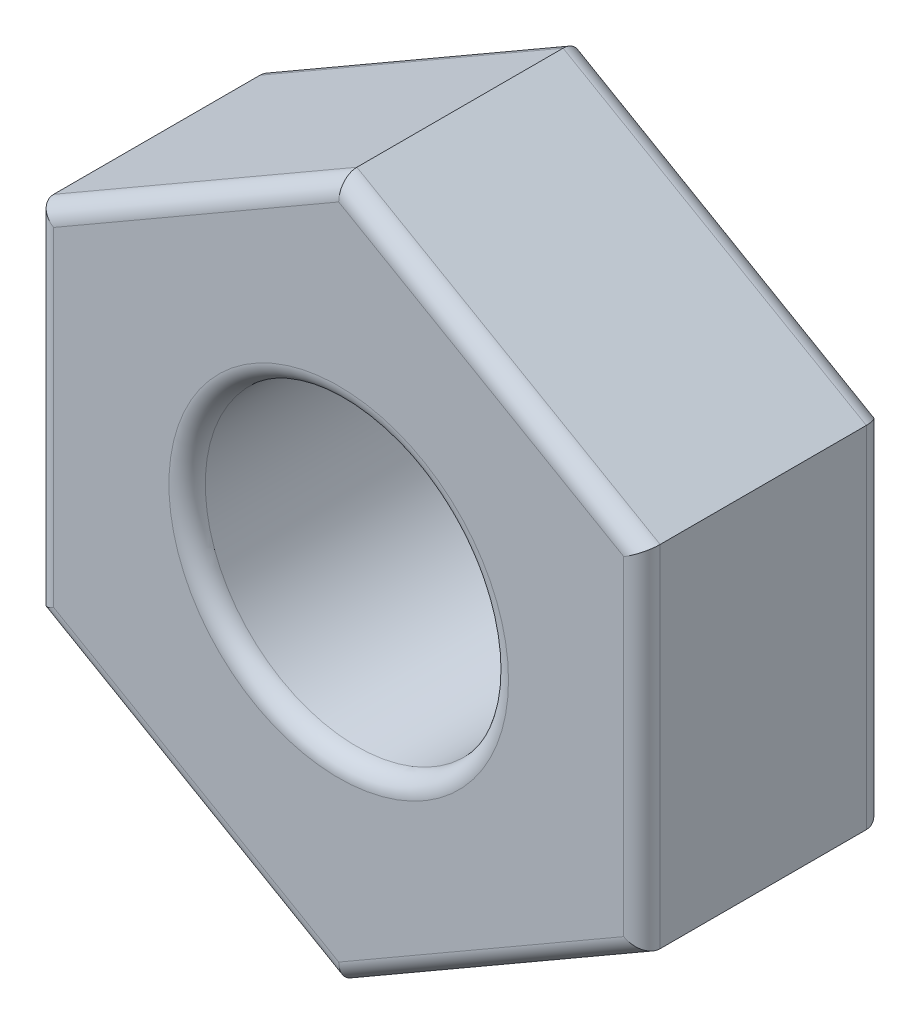
ISO-10303-21;
HEADER;
FILE_DESCRIPTION(('STEP AP214'),'2;1');
FILE_NAME('part.step','',(''),(''),'','','');
FILE_SCHEMA(('AUTOMOTIVE_DESIGN { 1 0 10303 214 1 1 1 1 }'));
ENDSEC;
DATA;
#1=APPLICATION_CONTEXT('core data for automotive mechanical design processes');
#2=APPLICATION_PROTOCOL_DEFINITION('international standard','automotive_design',2000,#1);
#3=PRODUCT_CONTEXT('',#1,'mechanical');
#4=PRODUCT('Part','Part','',(#3));
#5=PRODUCT_RELATED_PRODUCT_CATEGORY('part','',(#4));
#6=PRODUCT_DEFINITION_FORMATION('','',#4);
#7=PRODUCT_DEFINITION_CONTEXT('part definition',#1,'design');
#8=PRODUCT_DEFINITION('design','',#6,#7);
#9=PRODUCT_DEFINITION_SHAPE('','',#8);
#10=(LENGTH_UNIT() NAMED_UNIT(*) SI_UNIT(.MILLI.,.METRE.));
#11=(NAMED_UNIT(*) PLANE_ANGLE_UNIT() SI_UNIT($,.RADIAN.));
#12=(NAMED_UNIT(*) SI_UNIT($,.STERADIAN.) SOLID_ANGLE_UNIT());
#13=UNCERTAINTY_MEASURE_WITH_UNIT(LENGTH_MEASURE(1.E-05),#10,'distance_accuracy_value','');
#14=(GEOMETRIC_REPRESENTATION_CONTEXT(3) GLOBAL_UNCERTAINTY_ASSIGNED_CONTEXT((#13)) GLOBAL_UNIT_ASSIGNED_CONTEXT((#10,
#11,#12)) REPRESENTATION_CONTEXT('',''));
#15=CARTESIAN_POINT('',(0.,0.,0.));
#16=DIRECTION('',(0.,0.,1.));
#17=DIRECTION('',(1.,0.,0.));
#18=AXIS2_PLACEMENT_3D('',#15,#16,#17);
#19=CARTESIAN_POINT('',(0.,0.,2.));
#20=DIRECTION('',(0.,0.,1.));
#21=DIRECTION('',(1.,0.,0.));
#22=AXIS2_PLACEMENT_3D('',#19,#20,#21);
#23=PLANE('',#22);
#24=CARTESIAN_POINT('',(0.,0.,2.));
#25=DIRECTION('',(0.,0.,1.));
#26=DIRECTION('',(1.,0.,0.));
#27=AXIS2_PLACEMENT_3D('',#24,#25,#26);
#28=CIRCLE('',#27,1.4);
#29=CARTESIAN_POINT('',(1.4,0.,2.));
#30=VERTEX_POINT('',#29);
#31=EDGE_CURVE('E11',#30,#30,#28,.F.);
#32=ORIENTED_EDGE('',*,*,#31,.T.);
#33=EDGE_LOOP('',(#32));
#34=FACE_BOUND('',#33,.T.);
#35=DIRECTION('',(0.866025403784439,0.5,0.));
#36=VECTOR('',#35,1.);
#37=CARTESIAN_POINT('',(2.425,-1.3134718624064,2.));
#38=LINE('',#37,#36);
#39=CARTESIAN_POINT('',(0.,-2.71354626519124,2.));
#40=VERTEX_POINT('',#39);
#41=CARTESIAN_POINT('',(2.35,-1.35677313259562,2.));
#42=VERTEX_POINT('',#41);
#43=EDGE_CURVE('E53',#40,#42,#38,.T.);
#44=ORIENTED_EDGE('',*,*,#43,.T.);
#45=DIRECTION('',(0.,1.,0.));
#46=VECTOR('',#45,1.);
#47=CARTESIAN_POINT('',(2.35,1.44337567297407,2.));
#48=LINE('',#47,#46);
#49=CARTESIAN_POINT('',(2.35,1.35677313259562,2.));
#50=VERTEX_POINT('',#49);
#51=EDGE_CURVE('E45',#42,#50,#48,.T.);
#52=ORIENTED_EDGE('',*,*,#51,.T.);
#53=DIRECTION('',(-0.866025403784439,0.5,0.));
#54=VECTOR('',#53,1.);
#55=CARTESIAN_POINT('',(-0.075,2.75684753538046,2.));
#56=LINE('',#55,#54);
#57=CARTESIAN_POINT('',(0.,2.71354626519124,2.));
#58=VERTEX_POINT('',#57);
#59=EDGE_CURVE('E192',#50,#58,#56,.T.);
#60=ORIENTED_EDGE('',*,*,#59,.T.);
#61=DIRECTION('',(-0.866025403784439,-0.5,0.));
#62=VECTOR('',#61,1.);
#63=CARTESIAN_POINT('',(-2.425,1.3134718624064,2.));
#64=LINE('',#63,#62);
#65=CARTESIAN_POINT('',(-2.35,1.35677313259562,2.));
#66=VERTEX_POINT('',#65);
#67=EDGE_CURVE('E194',#58,#66,#64,.T.);
#68=ORIENTED_EDGE('',*,*,#67,.T.);
#69=DIRECTION('',(0.,-1.,0.));
#70=VECTOR('',#69,1.);
#71=CARTESIAN_POINT('',(-2.35,-1.44337567297406,2.));
#72=LINE('',#71,#70);
#73=CARTESIAN_POINT('',(-2.35,-1.35677313259562,2.));
#74=VERTEX_POINT('',#73);
#75=EDGE_CURVE('E196',#66,#74,#72,.T.);
#76=ORIENTED_EDGE('',*,*,#75,.T.);
#77=DIRECTION('',(0.866025403784439,-0.5,0.));
#78=VECTOR('',#77,1.);
#79=CARTESIAN_POINT('',(0.0749999999999995,-2.75684753538046,2.));
#80=LINE('',#79,#78);
#81=EDGE_CURVE('E58',#74,#40,#80,.T.);
#82=ORIENTED_EDGE('',*,*,#81,.T.);
#83=EDGE_LOOP('',(#44,#52,#60,#68,#76,#82));
#84=FACE_BOUND('',#83,.T.);
#85=ADVANCED_FACE('F36',(#34,#84),#23,.T.);
#86=CARTESIAN_POINT('',(0.,0.,0.));
#87=DIRECTION('',(0.,0.,1.));
#88=DIRECTION('',(1.,0.,0.));
#89=AXIS2_PLACEMENT_3D('',#86,#87,#88);
#90=PLANE('',#89);
#91=CARTESIAN_POINT('',(0.,0.,0.));
#92=DIRECTION('',(0.,0.,1.));
#93=DIRECTION('',(1.,0.,0.));
#94=AXIS2_PLACEMENT_3D('',#91,#92,#93);
#95=CIRCLE('',#94,1.4);
#96=CARTESIAN_POINT('',(1.4,0.,0.));
#97=VERTEX_POINT('',#96);
#98=EDGE_CURVE('E154',#97,#97,#95,.T.);
#99=ORIENTED_EDGE('',*,*,#98,.T.);
#100=EDGE_LOOP('',(#99));
#101=FACE_BOUND('',#100,.T.);
#102=DIRECTION('',(0.,-1.,0.));
#103=VECTOR('',#102,1.);
#104=CARTESIAN_POINT('',(-2.35,0.,0.));
#105=LINE('',#104,#103);
#106=CARTESIAN_POINT('',(-2.35,-1.35677313259562,0.));
#107=VERTEX_POINT('',#106);
#108=CARTESIAN_POINT('',(-2.35,1.35677313259562,0.));
#109=VERTEX_POINT('',#108);
#110=EDGE_CURVE('E153',#107,#109,#105,.F.);
#111=ORIENTED_EDGE('',*,*,#110,.T.);
#112=DIRECTION('',(-0.866025403784439,-0.5,0.));
#113=VECTOR('',#112,1.);
#114=CARTESIAN_POINT('',(-1.175,2.03515969889343,0.));
#115=LINE('',#114,#113);
#116=CARTESIAN_POINT('',(0.,2.71354626519124,0.));
#117=VERTEX_POINT('',#116);
#118=EDGE_CURVE('E132',#109,#117,#115,.F.);
#119=ORIENTED_EDGE('',*,*,#118,.T.);
#120=DIRECTION('',(-0.866025403784439,0.5,0.));
#121=VECTOR('',#120,1.);
#122=CARTESIAN_POINT('',(1.175,2.03515969889343,0.));
#123=LINE('',#122,#121);
#124=CARTESIAN_POINT('',(2.35,1.35677313259562,0.));
#125=VERTEX_POINT('',#124);
#126=EDGE_CURVE('E142',#117,#125,#123,.F.);
#127=ORIENTED_EDGE('',*,*,#126,.T.);
#128=DIRECTION('',(0.,1.,0.));
#129=VECTOR('',#128,1.);
#130=CARTESIAN_POINT('',(2.35,0.,0.));
#131=LINE('',#130,#129);
#132=CARTESIAN_POINT('',(2.35,-1.35677313259562,0.));
#133=VERTEX_POINT('',#132);
#134=EDGE_CURVE('E148',#125,#133,#131,.F.);
#135=ORIENTED_EDGE('',*,*,#134,.T.);
#136=DIRECTION('',(0.866025403784439,0.5,0.));
#137=VECTOR('',#136,1.);
#138=CARTESIAN_POINT('',(1.175,-2.03515969889343,0.));
#139=LINE('',#138,#137);
#140=CARTESIAN_POINT('',(0.,-2.71354626519124,0.));
#141=VERTEX_POINT('',#140);
#142=EDGE_CURVE('E254',#133,#141,#139,.F.);
#143=ORIENTED_EDGE('',*,*,#142,.T.);
#144=DIRECTION('',(0.866025403784439,-0.5,0.));
#145=VECTOR('',#144,1.);
#146=CARTESIAN_POINT('',(-1.175,-2.03515969889343,0.));
#147=LINE('',#146,#145);
#148=EDGE_CURVE('E159',#141,#107,#147,.F.);
#149=ORIENTED_EDGE('',*,*,#148,.T.);
#150=EDGE_LOOP('',(#111,#119,#127,#135,#143,#149));
#151=FACE_BOUND('',#150,.T.);
#152=ADVANCED_FACE('F151',(#101,#151),#90,.F.);
#153=CARTESIAN_POINT('',(2.5,1.44337567297407,2.));
#154=DIRECTION('',(-0.5,-0.866025403784439,0.));
#155=DIRECTION('',(0.866025403784439,-0.5,0.));
#156=AXIS2_PLACEMENT_3D('',#153,#154,#155);
#157=PLANE('',#156);
#158=DIRECTION('',(0.,0.,-1.));
#159=VECTOR('',#158,1.);
#160=CARTESIAN_POINT('',(2.5,1.44337567297407,2.));
#161=LINE('',#160,#159);
#162=CARTESIAN_POINT('',(2.5,1.44337567297407,1.85));
#163=VERTEX_POINT('',#162);
#164=CARTESIAN_POINT('',(2.5,1.44337567297407,0.15));
#165=VERTEX_POINT('',#164);
#166=EDGE_CURVE('E211',#163,#165,#161,.T.);
#167=ORIENTED_EDGE('',*,*,#166,.T.);
#168=DIRECTION('',(-0.866025403784439,0.5,0.));
#169=VECTOR('',#168,1.);
#170=CARTESIAN_POINT('',(2.5,1.44337567297407,0.15));
#171=LINE('',#170,#169);
#172=CARTESIAN_POINT('',(0.,2.88675134594813,0.15));
#173=VERTEX_POINT('',#172);
#174=EDGE_CURVE('E190',#165,#173,#171,.T.);
#175=ORIENTED_EDGE('',*,*,#174,.T.);
#176=DIRECTION('',(0.,0.,-1.));
#177=VECTOR('',#176,1.);
#178=CARTESIAN_POINT('',(0.,2.88675134594813,2.));
#179=LINE('',#178,#177);
#180=CARTESIAN_POINT('',(0.,2.88675134594813,1.85));
#181=VERTEX_POINT('',#180);
#182=EDGE_CURVE('E149',#181,#173,#179,.T.);
#183=ORIENTED_EDGE('',*,*,#182,.F.);
#184=DIRECTION('',(-0.866025403784439,0.5,0.));
#185=VECTOR('',#184,1.);
#186=CARTESIAN_POINT('',(2.5,1.44337567297407,1.85));
#187=LINE('',#186,#185);
#188=EDGE_CURVE('E188',#181,#163,#187,.F.);
#189=ORIENTED_EDGE('',*,*,#188,.T.);
#190=EDGE_LOOP('',(#167,#175,#183,#189));
#191=FACE_BOUND('',#190,.T.);
#192=ADVANCED_FACE('F278',(#191),#157,.F.);
#193=CARTESIAN_POINT('',(0.,2.88675134594813,2.));
#194=DIRECTION('',(0.5,-0.866025403784439,0.));
#195=DIRECTION('',(0.866025403784439,0.5,0.));
#196=AXIS2_PLACEMENT_3D('',#193,#194,#195);
#197=PLANE('',#196);
#198=ORIENTED_EDGE('',*,*,#182,.T.);
#199=DIRECTION('',(-0.866025403784439,-0.5,0.));
#200=VECTOR('',#199,1.);
#201=CARTESIAN_POINT('',(0.,2.88675134594813,0.15));
#202=LINE('',#201,#200);
#203=CARTESIAN_POINT('',(-2.5,1.44337567297407,0.15));
#204=VERTEX_POINT('',#203);
#205=EDGE_CURVE('E135',#173,#204,#202,.T.);
#206=ORIENTED_EDGE('',*,*,#205,.T.);
#207=DIRECTION('',(0.,0.,-1.));
#208=VECTOR('',#207,1.);
#209=CARTESIAN_POINT('',(-2.5,1.44337567297407,2.));
#210=LINE('',#209,#208);
#211=CARTESIAN_POINT('',(-2.5,1.44337567297407,1.85));
#212=VERTEX_POINT('',#211);
#213=EDGE_CURVE('E240',#212,#204,#210,.T.);
#214=ORIENTED_EDGE('',*,*,#213,.F.);
#215=DIRECTION('',(-0.866025403784439,-0.5,0.));
#216=VECTOR('',#215,1.);
#217=CARTESIAN_POINT('',(0.,2.88675134594813,1.85));
#218=LINE('',#217,#216);
#219=EDGE_CURVE('E168',#212,#181,#218,.F.);
#220=ORIENTED_EDGE('',*,*,#219,.T.);
#221=EDGE_LOOP('',(#198,#206,#214,#220));
#222=FACE_BOUND('',#221,.T.);
#223=ADVANCED_FACE('F245',(#222),#197,.F.);
#224=CARTESIAN_POINT('',(-2.5,1.44337567297407,2.));
#225=DIRECTION('',(1.,0.,0.));
#226=DIRECTION('',(0.,1.,0.));
#227=AXIS2_PLACEMENT_3D('',#224,#225,#226);
#228=PLANE('',#227);
#229=ORIENTED_EDGE('',*,*,#213,.T.);
#230=DIRECTION('',(0.,-1.,0.));
#231=VECTOR('',#230,1.);
#232=CARTESIAN_POINT('',(-2.5,1.44337567297407,0.15));
#233=LINE('',#232,#231);
#234=CARTESIAN_POINT('',(-2.5,-1.44337567297406,0.15));
#235=VERTEX_POINT('',#234);
#236=EDGE_CURVE('E173',#204,#235,#233,.T.);
#237=ORIENTED_EDGE('',*,*,#236,.T.);
#238=DIRECTION('',(0.,0.,-1.));
#239=VECTOR('',#238,1.);
#240=CARTESIAN_POINT('',(-2.5,-1.44337567297406,2.));
#241=LINE('',#240,#239);
#242=CARTESIAN_POINT('',(-2.5,-1.44337567297406,1.85));
#243=VERTEX_POINT('',#242);
#244=EDGE_CURVE('E242',#243,#235,#241,.T.);
#245=ORIENTED_EDGE('',*,*,#244,.F.);
#246=DIRECTION('',(0.,-1.,0.));
#247=VECTOR('',#246,1.);
#248=CARTESIAN_POINT('',(-2.5,1.44337567297407,1.85));
#249=LINE('',#248,#247);
#250=EDGE_CURVE('E171',#243,#212,#249,.F.);
#251=ORIENTED_EDGE('',*,*,#250,.T.);
#252=EDGE_LOOP('',(#229,#237,#245,#251));
#253=FACE_BOUND('',#252,.T.);
#254=ADVANCED_FACE('F239',(#253),#228,.F.);
#255=CARTESIAN_POINT('',(-2.5,-1.44337567297406,2.));
#256=DIRECTION('',(0.5,0.866025403784439,0.));
#257=DIRECTION('',(-0.866025403784439,0.5,0.));
#258=AXIS2_PLACEMENT_3D('',#255,#256,#257);
#259=PLANE('',#258);
#260=ORIENTED_EDGE('',*,*,#244,.T.);
#261=DIRECTION('',(0.866025403784439,-0.5,0.));
#262=VECTOR('',#261,1.);
#263=CARTESIAN_POINT('',(-2.5,-1.44337567297406,0.15));
#264=LINE('',#263,#262);
#265=CARTESIAN_POINT('',(0.,-2.88675134594813,0.15));
#266=VERTEX_POINT('',#265);
#267=EDGE_CURVE('E177',#235,#266,#264,.T.);
#268=ORIENTED_EDGE('',*,*,#267,.T.);
#269=DIRECTION('',(0.,0.,-1.));
#270=VECTOR('',#269,1.);
#271=CARTESIAN_POINT('',(0.,-2.88675134594813,2.));
#272=LINE('',#271,#270);
#273=CARTESIAN_POINT('',(0.,-2.88675134594813,1.85));
#274=VERTEX_POINT('',#273);
#275=EDGE_CURVE('E249',#274,#266,#272,.T.);
#276=ORIENTED_EDGE('',*,*,#275,.F.);
#277=DIRECTION('',(0.866025403784439,-0.5,0.));
#278=VECTOR('',#277,1.);
#279=CARTESIAN_POINT('',(-2.5,-1.44337567297406,1.85));
#280=LINE('',#279,#278);
#281=EDGE_CURVE('E175',#274,#243,#280,.F.);
#282=ORIENTED_EDGE('',*,*,#281,.T.);
#283=EDGE_LOOP('',(#260,#268,#276,#282));
#284=FACE_BOUND('',#283,.T.);
#285=ADVANCED_FACE('F266',(#284),#259,.F.);
#286=CARTESIAN_POINT('',(0.,-2.88675134594813,2.));
#287=DIRECTION('',(-0.5,0.866025403784439,0.));
#288=DIRECTION('',(-0.866025403784439,-0.5,0.));
#289=AXIS2_PLACEMENT_3D('',#286,#287,#288);
#290=PLANE('',#289);
#291=ORIENTED_EDGE('',*,*,#275,.T.);
#292=DIRECTION('',(0.866025403784439,0.5,0.));
#293=VECTOR('',#292,1.);
#294=CARTESIAN_POINT('',(0.,-2.88675134594813,0.15));
#295=LINE('',#294,#293);
#296=CARTESIAN_POINT('',(2.5,-1.44337567297407,0.15));
#297=VERTEX_POINT('',#296);
#298=EDGE_CURVE('E181',#266,#297,#295,.T.);
#299=ORIENTED_EDGE('',*,*,#298,.T.);
#300=DIRECTION('',(0.,0.,-1.));
#301=VECTOR('',#300,1.);
#302=CARTESIAN_POINT('',(2.5,-1.44337567297407,2.));
#303=LINE('',#302,#301);
#304=CARTESIAN_POINT('',(2.5,-1.44337567297407,1.85));
#305=VERTEX_POINT('',#304);
#306=EDGE_CURVE('E271',#305,#297,#303,.T.);
#307=ORIENTED_EDGE('',*,*,#306,.F.);
#308=DIRECTION('',(0.866025403784439,0.5,0.));
#309=VECTOR('',#308,1.);
#310=CARTESIAN_POINT('',(0.,-2.88675134594813,1.85));
#311=LINE('',#310,#309);
#312=EDGE_CURVE('E179',#305,#274,#311,.F.);
#313=ORIENTED_EDGE('',*,*,#312,.T.);
#314=EDGE_LOOP('',(#291,#299,#307,#313));
#315=FACE_BOUND('',#314,.T.);
#316=ADVANCED_FACE('F289',(#315),#290,.F.);
#317=CARTESIAN_POINT('',(2.5,-1.44337567297407,2.));
#318=DIRECTION('',(-1.,0.,0.));
#319=DIRECTION('',(0.,0.,1.));
#320=AXIS2_PLACEMENT_3D('',#317,#318,#319);
#321=PLANE('',#320);
#322=ORIENTED_EDGE('',*,*,#306,.T.);
#323=DIRECTION('',(0.,1.,0.));
#324=VECTOR('',#323,1.);
#325=CARTESIAN_POINT('',(2.5,-1.44337567297407,0.15));
#326=LINE('',#325,#324);
#327=EDGE_CURVE('E186',#297,#165,#326,.T.);
#328=ORIENTED_EDGE('',*,*,#327,.T.);
#329=ORIENTED_EDGE('',*,*,#166,.F.);
#330=DIRECTION('',(0.,1.,0.));
#331=VECTOR('',#330,1.);
#332=CARTESIAN_POINT('',(2.5,-1.44337567297407,1.85));
#333=LINE('',#332,#331);
#334=EDGE_CURVE('E183',#163,#305,#333,.F.);
#335=ORIENTED_EDGE('',*,*,#334,.T.);
#336=EDGE_LOOP('',(#322,#328,#329,#335));
#337=FACE_BOUND('',#336,.T.);
#338=ADVANCED_FACE('F290',(#337),#321,.F.);
#339=CARTESIAN_POINT('',(0.,0.,2.));
#340=DIRECTION('',(0.,0.,-1.));
#341=DIRECTION('',(-1.,0.,0.));
#342=AXIS2_PLACEMENT_3D('',#339,#340,#341);
#343=CYLINDRICAL_SURFACE('',#342,1.25);
#344=CARTESIAN_POINT('',(0.,0.,0.15));
#345=DIRECTION('',(0.,0.,1.));
#346=DIRECTION('',(1.,0.,0.));
#347=AXIS2_PLACEMENT_3D('',#344,#345,#346);
#348=CIRCLE('',#347,1.25);
#349=CARTESIAN_POINT('',(1.25,0.,0.15));
#350=VERTEX_POINT('',#349);
#351=EDGE_CURVE('E165',#350,#350,#348,.F.);
#352=ORIENTED_EDGE('',*,*,#351,.T.);
#353=EDGE_LOOP('',(#352));
#354=FACE_BOUND('',#353,.T.);
#355=CARTESIAN_POINT('',(0.,0.,1.85));
#356=DIRECTION('',(0.,0.,1.));
#357=DIRECTION('',(1.,0.,0.));
#358=AXIS2_PLACEMENT_3D('',#355,#356,#357);
#359=CIRCLE('',#358,1.25);
#360=CARTESIAN_POINT('',(1.25,0.,1.85));
#361=VERTEX_POINT('',#360);
#362=EDGE_CURVE('E157',#361,#361,#359,.T.);
#363=ORIENTED_EDGE('',*,*,#362,.T.);
#364=EDGE_LOOP('',(#363));
#365=FACE_BOUND('',#364,.T.);
#366=ADVANCED_FACE('F309',(#354,#365),#343,.F.);
#367=CARTESIAN_POINT('',(0.,0.,0.15));
#368=DIRECTION('',(0.,0.,1.));
#369=DIRECTION('',(1.,0.,0.));
#370=AXIS2_PLACEMENT_3D('',#367,#368,#369);
#371=TOROIDAL_SURFACE('',#370,1.4,0.15);
#372=ORIENTED_EDGE('',*,*,#351,.F.);
#373=EDGE_LOOP('',(#372));
#374=FACE_BOUND('',#373,.T.);
#375=ORIENTED_EDGE('',*,*,#98,.F.);
#376=EDGE_LOOP('',(#375));
#377=FACE_BOUND('',#376,.T.);
#378=ADVANCED_FACE('F323',(#374,#377),#371,.T.);
#379=CARTESIAN_POINT('',(-0.0750000000000005,-2.75684753538046,0.15));
#380=DIRECTION('',(0.866025403784439,0.5,0.));
#381=DIRECTION('',(-0.5,0.866025403784439,0.));
#382=AXIS2_PLACEMENT_3D('',#379,#380,#381);
#383=CYLINDRICAL_SURFACE('',#382,0.15);
#384=CARTESIAN_POINT('',(0.,-2.71354626519124,0.15));
#385=DIRECTION('',(1.,0.,0.));
#386=DIRECTION('',(0.,1.,0.));
#387=AXIS2_PLACEMENT_3D('',#384,#385,#386);
#388=ELLIPSE('',#387,0.173205080756888,0.15);
#389=EDGE_CURVE('E205',#141,#266,#388,.F.);
#390=ORIENTED_EDGE('',*,*,#389,.F.);
#391=ORIENTED_EDGE('',*,*,#142,.F.);
#392=CARTESIAN_POINT('',(2.35,-1.35677313259562,0.15));
#393=DIRECTION('',(0.5,0.866025403784439,0.));
#394=DIRECTION('',(-0.866025403784439,0.5,0.));
#395=AXIS2_PLACEMENT_3D('',#392,#393,#394);
#396=ELLIPSE('',#395,0.173205080756888,0.15);
#397=EDGE_CURVE('E208',#297,#133,#396,.T.);
#398=ORIENTED_EDGE('',*,*,#397,.F.);
#399=ORIENTED_EDGE('',*,*,#298,.F.);
#400=EDGE_LOOP('',(#390,#391,#398,#399));
#401=FACE_BOUND('',#400,.T.);
#402=ADVANCED_FACE('F287',(#401),#383,.T.);
#403=CARTESIAN_POINT('',(2.35,-1.44337567297407,0.15));
#404=DIRECTION('',(0.,1.,0.));
#405=DIRECTION('',(0.,0.,1.));
#406=AXIS2_PLACEMENT_3D('',#403,#404,#405);
#407=CYLINDRICAL_SURFACE('',#406,0.15);
#408=ORIENTED_EDGE('',*,*,#397,.T.);
#409=ORIENTED_EDGE('',*,*,#134,.F.);
#410=CARTESIAN_POINT('',(2.35,1.35677313259562,0.15));
#411=DIRECTION('',(-0.5,0.866025403784439,0.));
#412=DIRECTION('',(-0.866025403784439,-0.5,0.));
#413=AXIS2_PLACEMENT_3D('',#410,#411,#412);
#414=ELLIPSE('',#413,0.173205080756888,0.15);
#415=EDGE_CURVE('E145',#165,#125,#414,.T.);
#416=ORIENTED_EDGE('',*,*,#415,.F.);
#417=ORIENTED_EDGE('',*,*,#327,.F.);
#418=EDGE_LOOP('',(#408,#409,#416,#417));
#419=FACE_BOUND('',#418,.T.);
#420=ADVANCED_FACE('F284',(#419),#407,.T.);
#421=CARTESIAN_POINT('',(-2.425,-1.3134718624064,0.15));
#422=DIRECTION('',(0.866025403784439,-0.5,0.));
#423=DIRECTION('',(0.5,0.866025403784439,0.));
#424=AXIS2_PLACEMENT_3D('',#421,#422,#423);
#425=CYLINDRICAL_SURFACE('',#424,0.15);
#426=ORIENTED_EDGE('',*,*,#389,.T.);
#427=ORIENTED_EDGE('',*,*,#267,.F.);
#428=CARTESIAN_POINT('',(-2.35,-1.35677313259562,0.15));
#429=DIRECTION('',(0.5,-0.866025403784439,0.));
#430=DIRECTION('',(0.866025403784439,0.5,0.));
#431=AXIS2_PLACEMENT_3D('',#428,#429,#430);
#432=ELLIPSE('',#431,0.173205080756888,0.15);
#433=EDGE_CURVE('E138',#107,#235,#432,.F.);
#434=ORIENTED_EDGE('',*,*,#433,.F.);
#435=ORIENTED_EDGE('',*,*,#148,.F.);
#436=EDGE_LOOP('',(#426,#427,#434,#435));
#437=FACE_BOUND('',#436,.T.);
#438=ADVANCED_FACE('F261',(#437),#425,.T.);
#439=CARTESIAN_POINT('',(2.425,1.3134718624064,0.15));
#440=DIRECTION('',(-0.866025403784439,0.5,0.));
#441=DIRECTION('',(-0.5,-0.866025403784439,0.));
#442=AXIS2_PLACEMENT_3D('',#439,#440,#441);
#443=CYLINDRICAL_SURFACE('',#442,0.15);
#444=ORIENTED_EDGE('',*,*,#415,.T.);
#445=ORIENTED_EDGE('',*,*,#126,.F.);
#446=CARTESIAN_POINT('',(0.,2.71354626519124,0.15));
#447=DIRECTION('',(-1.,0.,0.));
#448=DIRECTION('',(0.,1.,0.));
#449=AXIS2_PLACEMENT_3D('',#446,#447,#448);
#450=ELLIPSE('',#449,0.173205080756888,0.15);
#451=EDGE_CURVE('E128',#173,#117,#450,.T.);
#452=ORIENTED_EDGE('',*,*,#451,.F.);
#453=ORIENTED_EDGE('',*,*,#174,.F.);
#454=EDGE_LOOP('',(#444,#445,#452,#453));
#455=FACE_BOUND('',#454,.T.);
#456=ADVANCED_FACE('F143',(#455),#443,.T.);
#457=CARTESIAN_POINT('',(-2.35,1.44337567297407,0.15));
#458=DIRECTION('',(0.,-1.,0.));
#459=DIRECTION('',(1.,0.,0.));
#460=AXIS2_PLACEMENT_3D('',#457,#458,#459);
#461=CYLINDRICAL_SURFACE('',#460,0.15);
#462=ORIENTED_EDGE('',*,*,#433,.T.);
#463=ORIENTED_EDGE('',*,*,#236,.F.);
#464=CARTESIAN_POINT('',(-2.35,1.35677313259562,0.15));
#465=DIRECTION('',(-0.5,-0.866025403784438,0.));
#466=DIRECTION('',(0.866025403784438,-0.5,0.));
#467=AXIS2_PLACEMENT_3D('',#464,#465,#466);
#468=ELLIPSE('',#467,0.173205080756888,0.15);
#469=EDGE_CURVE('E139',#109,#204,#468,.F.);
#470=ORIENTED_EDGE('',*,*,#469,.F.);
#471=ORIENTED_EDGE('',*,*,#110,.F.);
#472=EDGE_LOOP('',(#462,#463,#470,#471));
#473=FACE_BOUND('',#472,.T.);
#474=ADVANCED_FACE('F264',(#473),#461,.T.);
#475=CARTESIAN_POINT('',(0.0750000000000004,2.75684753538046,0.15));
#476=DIRECTION('',(-0.866025403784439,-0.5,0.));
#477=DIRECTION('',(0.5,-0.866025403784439,0.));
#478=AXIS2_PLACEMENT_3D('',#475,#476,#477);
#479=CYLINDRICAL_SURFACE('',#478,0.15);
#480=ORIENTED_EDGE('',*,*,#451,.T.);
#481=ORIENTED_EDGE('',*,*,#118,.F.);
#482=ORIENTED_EDGE('',*,*,#469,.T.);
#483=ORIENTED_EDGE('',*,*,#205,.F.);
#484=EDGE_LOOP('',(#480,#481,#482,#483));
#485=FACE_BOUND('',#484,.T.);
#486=ADVANCED_FACE('F130',(#485),#479,.T.);
#487=CARTESIAN_POINT('',(0.,0.,1.85));
#488=DIRECTION('',(0.,0.,1.));
#489=DIRECTION('',(1.,0.,0.));
#490=AXIS2_PLACEMENT_3D('',#487,#488,#489);
#491=TOROIDAL_SURFACE('',#490,1.4,0.15);
#492=ORIENTED_EDGE('',*,*,#31,.F.);
#493=EDGE_LOOP('',(#492));
#494=FACE_BOUND('',#493,.T.);
#495=ORIENTED_EDGE('',*,*,#362,.F.);
#496=EDGE_LOOP('',(#495));
#497=FACE_BOUND('',#496,.T.);
#498=ADVANCED_FACE('F329',(#494,#497),#491,.T.);
#499=CARTESIAN_POINT('',(-2.35,0.,1.85));
#500=DIRECTION('',(0.,1.,0.));
#501=DIRECTION('',(-1.,0.,0.));
#502=AXIS2_PLACEMENT_3D('',#499,#500,#501);
#503=CYLINDRICAL_SURFACE('',#502,0.15);
#504=CARTESIAN_POINT('',(-2.35,1.35677313259562,1.85));
#505=DIRECTION('',(0.5,0.866025403784438,0.));
#506=DIRECTION('',(0.866025403784438,-0.5,0.));
#507=AXIS2_PLACEMENT_3D('',#504,#505,#506);
#508=ELLIPSE('',#507,0.173205080756888,0.15);
#509=EDGE_CURVE('E221',#212,#66,#508,.T.);
#510=ORIENTED_EDGE('',*,*,#509,.F.);
#511=ORIENTED_EDGE('',*,*,#250,.F.);
#512=CARTESIAN_POINT('',(-2.35,-1.35677313259562,1.85));
#513=DIRECTION('',(-0.5,0.866025403784439,0.));
#514=DIRECTION('',(0.866025403784439,0.5,0.));
#515=AXIS2_PLACEMENT_3D('',#512,#513,#514);
#516=ELLIPSE('',#515,0.173205080756888,0.15);
#517=EDGE_CURVE('E40',#74,#243,#516,.F.);
#518=ORIENTED_EDGE('',*,*,#517,.F.);
#519=ORIENTED_EDGE('',*,*,#75,.F.);
#520=EDGE_LOOP('',(#510,#511,#518,#519));
#521=FACE_BOUND('',#520,.T.);
#522=ADVANCED_FACE('F38',(#521),#503,.T.);
#523=CARTESIAN_POINT('',(-1.175,-2.03515969889343,1.85));
#524=DIRECTION('',(-0.866025403784439,0.5,0.));
#525=DIRECTION('',(-0.5,-0.866025403784439,0.));
#526=AXIS2_PLACEMENT_3D('',#523,#524,#525);
#527=CYLINDRICAL_SURFACE('',#526,0.15);
#528=ORIENTED_EDGE('',*,*,#517,.T.);
#529=ORIENTED_EDGE('',*,*,#281,.F.);
#530=CARTESIAN_POINT('',(0.,-2.71354626519124,1.85));
#531=DIRECTION('',(-1.,0.,0.));
#532=DIRECTION('',(0.,1.,0.));
#533=AXIS2_PLACEMENT_3D('',#530,#531,#532);
#534=ELLIPSE('',#533,0.173205080756888,0.15);
#535=EDGE_CURVE('E219',#40,#274,#534,.F.);
#536=ORIENTED_EDGE('',*,*,#535,.F.);
#537=ORIENTED_EDGE('',*,*,#81,.F.);
#538=EDGE_LOOP('',(#528,#529,#536,#537));
#539=FACE_BOUND('',#538,.T.);
#540=ADVANCED_FACE('F231',(#539),#527,.T.);
#541=CARTESIAN_POINT('',(-1.175,2.03515969889343,1.85));
#542=DIRECTION('',(0.866025403784439,0.5,0.));
#543=DIRECTION('',(-0.5,0.866025403784439,0.));
#544=AXIS2_PLACEMENT_3D('',#541,#542,#543);
#545=CYLINDRICAL_SURFACE('',#544,0.15);
#546=ORIENTED_EDGE('',*,*,#509,.T.);
#547=ORIENTED_EDGE('',*,*,#67,.F.);
#548=CARTESIAN_POINT('',(0.,2.71354626519124,1.85));
#549=DIRECTION('',(1.,0.,0.));
#550=DIRECTION('',(0.,-1.,0.));
#551=AXIS2_PLACEMENT_3D('',#548,#549,#550);
#552=ELLIPSE('',#551,0.173205080756888,0.15);
#553=EDGE_CURVE('E216',#181,#58,#552,.T.);
#554=ORIENTED_EDGE('',*,*,#553,.F.);
#555=ORIENTED_EDGE('',*,*,#219,.F.);
#556=EDGE_LOOP('',(#546,#547,#554,#555));
#557=FACE_BOUND('',#556,.T.);
#558=ADVANCED_FACE('F350',(#557),#545,.T.);
#559=CARTESIAN_POINT('',(1.175,-2.03515969889343,1.85));
#560=DIRECTION('',(-0.866025403784439,-0.5,0.));
#561=DIRECTION('',(0.5,-0.866025403784439,0.));
#562=AXIS2_PLACEMENT_3D('',#559,#560,#561);
#563=CYLINDRICAL_SURFACE('',#562,0.15);
#564=ORIENTED_EDGE('',*,*,#535,.T.);
#565=ORIENTED_EDGE('',*,*,#312,.F.);
#566=CARTESIAN_POINT('',(2.35,-1.35677313259562,1.85));
#567=DIRECTION('',(-0.5,-0.866025403784439,0.));
#568=DIRECTION('',(-0.866025403784439,0.5,0.));
#569=AXIS2_PLACEMENT_3D('',#566,#567,#568);
#570=ELLIPSE('',#569,0.173205080756888,0.15);
#571=EDGE_CURVE('E214',#42,#305,#570,.F.);
#572=ORIENTED_EDGE('',*,*,#571,.F.);
#573=ORIENTED_EDGE('',*,*,#43,.F.);
#574=EDGE_LOOP('',(#564,#565,#572,#573));
#575=FACE_BOUND('',#574,.T.);
#576=ADVANCED_FACE('F347',(#575),#563,.T.);
#577=CARTESIAN_POINT('',(1.175,2.03515969889343,1.85));
#578=DIRECTION('',(0.866025403784439,-0.5,0.));
#579=DIRECTION('',(0.5,0.866025403784439,0.));
#580=AXIS2_PLACEMENT_3D('',#577,#578,#579);
#581=CYLINDRICAL_SURFACE('',#580,0.15);
#582=ORIENTED_EDGE('',*,*,#553,.T.);
#583=ORIENTED_EDGE('',*,*,#59,.F.);
#584=CARTESIAN_POINT('',(2.35,1.35677313259562,1.85));
#585=DIRECTION('',(0.5,-0.866025403784439,0.));
#586=DIRECTION('',(0.866025403784439,0.5,0.));
#587=AXIS2_PLACEMENT_3D('',#584,#585,#586);
#588=ELLIPSE('',#587,0.173205080756888,0.15);
#589=EDGE_CURVE('E212',#163,#50,#588,.T.);
#590=ORIENTED_EDGE('',*,*,#589,.F.);
#591=ORIENTED_EDGE('',*,*,#188,.F.);
#592=EDGE_LOOP('',(#582,#583,#590,#591));
#593=FACE_BOUND('',#592,.T.);
#594=ADVANCED_FACE('F298',(#593),#581,.T.);
#595=CARTESIAN_POINT('',(2.35,0.,1.85));
#596=DIRECTION('',(0.,-1.,0.));
#597=DIRECTION('',(0.,0.,-1.));
#598=AXIS2_PLACEMENT_3D('',#595,#596,#597);
#599=CYLINDRICAL_SURFACE('',#598,0.15);
#600=ORIENTED_EDGE('',*,*,#571,.T.);
#601=ORIENTED_EDGE('',*,*,#334,.F.);
#602=ORIENTED_EDGE('',*,*,#589,.T.);
#603=ORIENTED_EDGE('',*,*,#51,.F.);
#604=EDGE_LOOP('',(#600,#601,#602,#603));
#605=FACE_BOUND('',#604,.T.);
#606=ADVANCED_FACE('F293',(#605),#599,.T.);
#607=CLOSED_SHELL('',(#85,#152,#192,#223,#254,#285,#316,#338,#366,#378,#402,#420,#438,#456,#474,
#486,#498,#522,#540,#558,#576,#594,#606));
#608=MANIFOLD_SOLID_BREP('B2',#607);
#609=ADVANCED_BREP_SHAPE_REPRESENTATION('',(#18,#608),#14);
#610=SHAPE_DEFINITION_REPRESENTATION(#9,#609);
ENDSEC;
END-ISO-10303-21;
